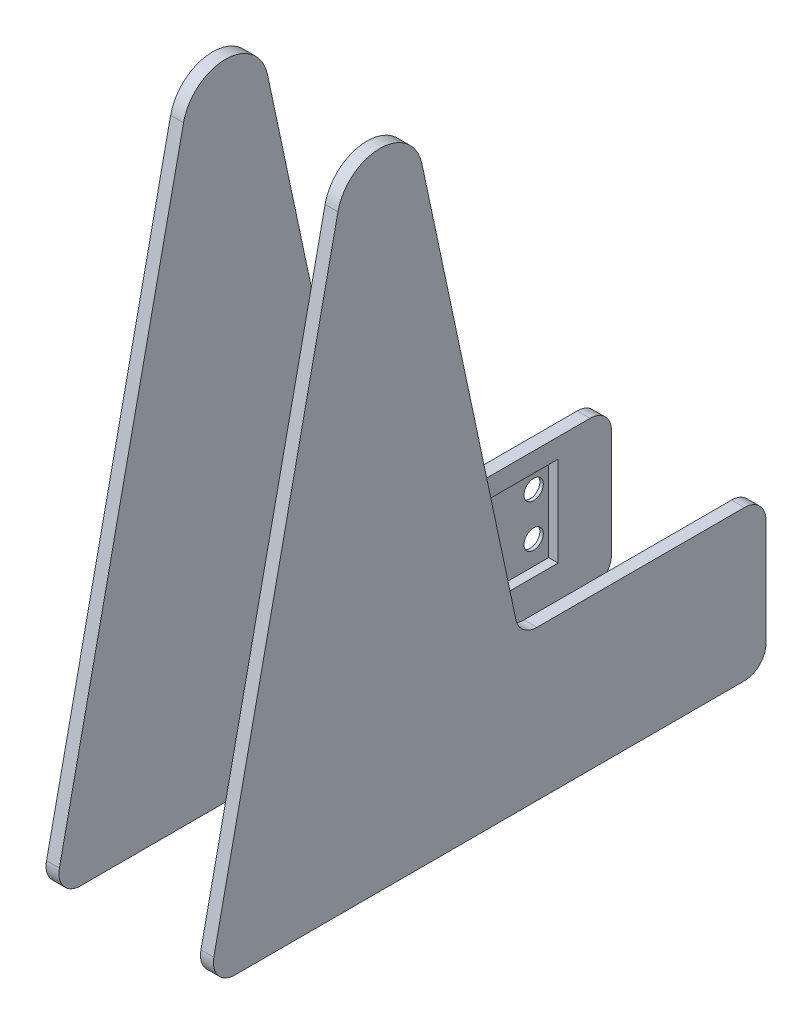
ISO-10303-21;
HEADER;
FILE_DESCRIPTION(('STEP AP214'),'2;1');
FILE_NAME('part.step','',(''),(''),'','','');
FILE_SCHEMA(('AUTOMOTIVE_DESIGN { 1 0 10303 214 1 1 1 1 }'));
ENDSEC;
DATA;
#1=APPLICATION_CONTEXT('core data for automotive mechanical design processes');
#2=APPLICATION_PROTOCOL_DEFINITION('international standard','automotive_design',2000,#1);
#3=PRODUCT_CONTEXT('',#1,'mechanical');
#4=PRODUCT('Part','Part','',(#3));
#5=PRODUCT_RELATED_PRODUCT_CATEGORY('part','',(#4));
#6=PRODUCT_DEFINITION_FORMATION('','',#4);
#7=PRODUCT_DEFINITION_CONTEXT('part definition',#1,'design');
#8=PRODUCT_DEFINITION('design','',#6,#7);
#9=PRODUCT_DEFINITION_SHAPE('','',#8);
#10=(LENGTH_UNIT() NAMED_UNIT(*) SI_UNIT(.MILLI.,.METRE.));
#11=(NAMED_UNIT(*) PLANE_ANGLE_UNIT() SI_UNIT($,.RADIAN.));
#12=(NAMED_UNIT(*) SI_UNIT($,.STERADIAN.) SOLID_ANGLE_UNIT());
#13=UNCERTAINTY_MEASURE_WITH_UNIT(LENGTH_MEASURE(1.E-05),#10,'distance_accuracy_value','');
#14=(GEOMETRIC_REPRESENTATION_CONTEXT(3) GLOBAL_UNCERTAINTY_ASSIGNED_CONTEXT((#13)) GLOBAL_UNIT_ASSIGNED_CONTEXT((#10,
#11,#12)) REPRESENTATION_CONTEXT('',''));
#15=CARTESIAN_POINT('',(0.,0.,0.));
#16=DIRECTION('',(0.,0.,1.));
#17=DIRECTION('',(1.,0.,0.));
#18=AXIS2_PLACEMENT_3D('',#15,#16,#17);
#19=CARTESIAN_POINT('',(-19.5,0.,0.));
#20=DIRECTION('',(-1.,0.,0.));
#21=DIRECTION('',(0.,0.,-1.));
#22=AXIS2_PLACEMENT_3D('',#19,#20,#21);
#23=PLANE('',#22);
#24=CARTESIAN_POINT('',(-19.5,15.,-25.55));
#25=DIRECTION('',(1.,0.,0.));
#26=DIRECTION('',(0.,0.,-1.));
#27=AXIS2_PLACEMENT_3D('',#24,#25,#26);
#28=CIRCLE('',#27,2.25);
#29=CARTESIAN_POINT('',(-19.5,15.,-27.8));
#30=VERTEX_POINT('',#29);
#31=EDGE_CURVE('E408',#30,#30,#28,.T.);
#32=ORIENTED_EDGE('',*,*,#31,.T.);
#33=EDGE_LOOP('',(#32));
#34=FACE_BOUND('',#33,.T.);
#35=CARTESIAN_POINT('',(-19.5,140.,0.));
#36=DIRECTION('',(1.,0.,0.));
#37=DIRECTION('',(0.,0.,-1.));
#38=AXIS2_PLACEMENT_3D('',#35,#36,#37);
#39=CIRCLE('',#38,9.99999999999999);
#40=CARTESIAN_POINT('',(-19.5,142.080346989874,9.78121446456016));
#41=VERTEX_POINT('',#40);
#42=CARTESIAN_POINT('',(-19.5,142.080346989874,-9.78121446456015));
#43=VERTEX_POINT('',#42);
#44=EDGE_CURVE('E199',#41,#43,#39,.F.);
#45=ORIENTED_EDGE('',*,*,#44,.T.);
#46=DIRECTION('',(0.,-0.978121446456016,-0.208034698987433));
#47=VECTOR('',#46,1.);
#48=CARTESIAN_POINT('',(-19.5,8.1393280274652,-38.2688625606883));
#49=LINE('',#48,#47);
#50=CARTESIAN_POINT('',(-19.5,38.9598265050628,-31.7137122297545));
#51=VERTEX_POINT('',#50);
#52=EDGE_CURVE('E77',#43,#51,#49,.T.);
#53=ORIENTED_EDGE('',*,*,#52,.T.);
#54=CARTESIAN_POINT('',(-19.5,40.,-36.6043194620345));
#55=DIRECTION('',(1.,0.,0.));
#56=DIRECTION('',(0.,0.,-1.));
#57=AXIS2_PLACEMENT_3D('',#54,#55,#56);
#58=CIRCLE('',#57,5.);
#59=CARTESIAN_POINT('',(-19.5,35.,-36.6043194620345));
#60=VERTEX_POINT('',#59);
#61=EDGE_CURVE('E145',#60,#51,#58,.F.);
#62=ORIENTED_EDGE('',*,*,#61,.F.);
#63=DIRECTION('',(0.,0.,-1.));
#64=VECTOR('',#63,1.);
#65=CARTESIAN_POINT('',(-19.5,35.,0.));
#66=LINE('',#65,#64);
#67=CARTESIAN_POINT('',(-19.5,35.,-85.));
#68=VERTEX_POINT('',#67);
#69=EDGE_CURVE('E149',#60,#68,#66,.T.);
#70=ORIENTED_EDGE('',*,*,#69,.T.);
#71=CARTESIAN_POINT('',(-19.5,30.,-85.));
#72=DIRECTION('',(1.,0.,0.));
#73=DIRECTION('',(0.,0.,-1.));
#74=AXIS2_PLACEMENT_3D('',#71,#72,#73);
#75=CIRCLE('',#74,5.);
#76=CARTESIAN_POINT('',(-19.5,30.,-90.));
#77=VERTEX_POINT('',#76);
#78=EDGE_CURVE('E166',#77,#68,#75,.T.);
#79=ORIENTED_EDGE('',*,*,#78,.F.);
#80=DIRECTION('',(0.,-1.,0.));
#81=VECTOR('',#80,1.);
#82=CARTESIAN_POINT('',(-19.5,0.,-90.));
#83=LINE('',#82,#81);
#84=CARTESIAN_POINT('',(-19.5,5.,-90.));
#85=VERTEX_POINT('',#84);
#86=EDGE_CURVE('E168',#77,#85,#83,.T.);
#87=ORIENTED_EDGE('',*,*,#86,.T.);
#88=CARTESIAN_POINT('',(-19.5,5.,-85.));
#89=DIRECTION('',(1.,0.,0.));
#90=DIRECTION('',(0.,0.,-1.));
#91=AXIS2_PLACEMENT_3D('',#88,#89,#90);
#92=CIRCLE('',#91,5.);
#93=CARTESIAN_POINT('',(-19.5,0.,-85.));
#94=VERTEX_POINT('',#93);
#95=EDGE_CURVE('E234',#94,#85,#92,.T.);
#96=ORIENTED_EDGE('',*,*,#95,.F.);
#97=DIRECTION('',(0.,0.,-1.));
#98=VECTOR('',#97,1.);
#99=CARTESIAN_POINT('',(-19.5,0.,0.));
#100=LINE('',#99,#98);
#101=CARTESIAN_POINT('',(-19.5,0.,33.8247203178887));
#102=VERTEX_POINT('',#101);
#103=EDGE_CURVE('E231',#102,#94,#100,.T.);
#104=ORIENTED_EDGE('',*,*,#103,.F.);
#105=CARTESIAN_POINT('',(-19.5,5.,33.8247203178887));
#106=DIRECTION('',(1.,0.,0.));
#107=DIRECTION('',(0.,0.,-1.));
#108=AXIS2_PLACEMENT_3D('',#105,#106,#107);
#109=CIRCLE('',#108,4.99999999999999);
#110=CARTESIAN_POINT('',(-19.5,6.04017349493716,38.7153275501688));
#111=VERTEX_POINT('',#110);
#112=EDGE_CURVE('E225',#111,#102,#109,.T.);
#113=ORIENTED_EDGE('',*,*,#112,.F.);
#114=DIRECTION('',(0.,-0.978121446456016,0.208034698987433));
#115=VECTOR('',#114,1.);
#116=CARTESIAN_POINT('',(-19.5,8.13932802746519,38.2688625606883));
#117=LINE('',#116,#115);
#118=EDGE_CURVE('E123',#41,#111,#117,.T.);
#119=ORIENTED_EDGE('',*,*,#118,.F.);
#120=EDGE_LOOP('',(#45,#53,#62,#70,#79,#87,#96,#104,#113,#119));
#121=FACE_BOUND('',#120,.T.);
#122=CARTESIAN_POINT('',(-19.5,25.,-25.55));
#123=DIRECTION('',(1.,0.,0.));
#124=DIRECTION('',(0.,0.,-1.));
#125=AXIS2_PLACEMENT_3D('',#122,#123,#124);
#126=CIRCLE('',#125,2.25);
#127=CARTESIAN_POINT('',(-19.5,25.,-27.8));
#128=VERTEX_POINT('',#127);
#129=EDGE_CURVE('E430',#128,#128,#126,.T.);
#130=ORIENTED_EDGE('',*,*,#129,.T.);
#131=EDGE_LOOP('',(#130));
#132=FACE_BOUND('',#131,.T.);
#133=CARTESIAN_POINT('',(-19.5,25.,-74.05));
#134=DIRECTION('',(1.,0.,0.));
#135=DIRECTION('',(0.,0.,-1.));
#136=AXIS2_PLACEMENT_3D('',#133,#134,#135);
#137=CIRCLE('',#136,2.25);
#138=CARTESIAN_POINT('',(-19.5,25.,-76.3));
#139=VERTEX_POINT('',#138);
#140=EDGE_CURVE('E424',#139,#139,#137,.T.);
#141=ORIENTED_EDGE('',*,*,#140,.T.);
#142=EDGE_LOOP('',(#141));
#143=FACE_BOUND('',#142,.T.);
#144=CARTESIAN_POINT('',(-19.5,15.,-74.05));
#145=DIRECTION('',(1.,0.,0.));
#146=DIRECTION('',(0.,0.,-1.));
#147=AXIS2_PLACEMENT_3D('',#144,#145,#146);
#148=CIRCLE('',#147,2.25);
#149=CARTESIAN_POINT('',(-19.5,15.,-76.3));
#150=VERTEX_POINT('',#149);
#151=EDGE_CURVE('E418',#150,#150,#148,.T.);
#152=ORIENTED_EDGE('',*,*,#151,.T.);
#153=EDGE_LOOP('',(#152));
#154=FACE_BOUND('',#153,.T.);
#155=ADVANCED_FACE('F53',(#34,#121,#132,#143,#154),#23,.T.);
#156=CARTESIAN_POINT('',(-18.7,0.,0.));
#157=DIRECTION('',(-1.,0.,0.));
#158=DIRECTION('',(0.,0.,1.));
#159=AXIS2_PLACEMENT_3D('',#156,#157,#158);
#160=PLANE('',#159);
#161=CARTESIAN_POINT('',(-18.7,15.,-25.55));
#162=DIRECTION('',(1.,0.,0.));
#163=DIRECTION('',(0.,0.,-1.));
#164=AXIS2_PLACEMENT_3D('',#161,#162,#163);
#165=CIRCLE('',#164,2.25);
#166=CARTESIAN_POINT('',(-18.7,15.,-27.8));
#167=VERTEX_POINT('',#166);
#168=EDGE_CURVE('E411',#167,#167,#165,.T.);
#169=ORIENTED_EDGE('',*,*,#168,.F.);
#170=EDGE_LOOP('',(#169));
#171=FACE_BOUND('',#170,.T.);
#172=CARTESIAN_POINT('',(-18.7,15.,-74.05));
#173=DIRECTION('',(1.,0.,0.));
#174=DIRECTION('',(0.,0.,-1.));
#175=AXIS2_PLACEMENT_3D('',#172,#173,#174);
#176=CIRCLE('',#175,2.25);
#177=CARTESIAN_POINT('',(-18.7,15.,-76.3));
#178=VERTEX_POINT('',#177);
#179=EDGE_CURVE('E413',#178,#178,#176,.T.);
#180=ORIENTED_EDGE('',*,*,#179,.F.);
#181=EDGE_LOOP('',(#180));
#182=FACE_BOUND('',#181,.T.);
#183=CARTESIAN_POINT('',(-18.7,25.,-25.55));
#184=DIRECTION('',(1.,0.,0.));
#185=DIRECTION('',(0.,0.,-1.));
#186=AXIS2_PLACEMENT_3D('',#183,#184,#185);
#187=CIRCLE('',#186,2.25);
#188=CARTESIAN_POINT('',(-18.7,25.,-27.8));
#189=VERTEX_POINT('',#188);
#190=EDGE_CURVE('E427',#189,#189,#187,.T.);
#191=ORIENTED_EDGE('',*,*,#190,.F.);
#192=EDGE_LOOP('',(#191));
#193=FACE_BOUND('',#192,.T.);
#194=DIRECTION('',(0.,1.,0.));
#195=VECTOR('',#194,1.);
#196=CARTESIAN_POINT('',(-18.7,30.4866025403784,-22.05));
#197=LINE('',#196,#195);
#198=CARTESIAN_POINT('',(-18.7,9.5,-22.05));
#199=VERTEX_POINT('',#198);
#200=CARTESIAN_POINT('',(-18.7,30.4866025403784,-22.05));
#201=VERTEX_POINT('',#200);
#202=EDGE_CURVE('E440',#199,#201,#197,.T.);
#203=ORIENTED_EDGE('',*,*,#202,.F.);
#204=DIRECTION('',(0.,0.,1.));
#205=VECTOR('',#204,1.);
#206=CARTESIAN_POINT('',(-18.7,9.5,-77.55));
#207=LINE('',#206,#205);
#208=CARTESIAN_POINT('',(-18.7,9.5,-77.55));
#209=VERTEX_POINT('',#208);
#210=EDGE_CURVE('E449',#209,#199,#207,.T.);
#211=ORIENTED_EDGE('',*,*,#210,.F.);
#212=DIRECTION('',(0.,-1.,0.));
#213=VECTOR('',#212,1.);
#214=CARTESIAN_POINT('',(-18.7,30.4866025403784,-77.55));
#215=LINE('',#214,#213);
#216=CARTESIAN_POINT('',(-18.7,30.4866025403784,-77.55));
#217=VERTEX_POINT('',#216);
#218=EDGE_CURVE('E446',#217,#209,#215,.T.);
#219=ORIENTED_EDGE('',*,*,#218,.F.);
#220=DIRECTION('',(0.,0.,-1.));
#221=VECTOR('',#220,1.);
#222=CARTESIAN_POINT('',(-18.7,30.4866025403784,-77.55));
#223=LINE('',#222,#221);
#224=EDGE_CURVE('E443',#201,#217,#223,.T.);
#225=ORIENTED_EDGE('',*,*,#224,.F.);
#226=EDGE_LOOP('',(#203,#211,#219,#225));
#227=FACE_BOUND('',#226,.T.);
#228=CARTESIAN_POINT('',(-18.7,25.,-74.05));
#229=DIRECTION('',(1.,0.,0.));
#230=DIRECTION('',(0.,0.,-1.));
#231=AXIS2_PLACEMENT_3D('',#228,#229,#230);
#232=CIRCLE('',#231,2.25);
#233=CARTESIAN_POINT('',(-18.7,25.,-76.3));
#234=VERTEX_POINT('',#233);
#235=EDGE_CURVE('E421',#234,#234,#232,.T.);
#236=ORIENTED_EDGE('',*,*,#235,.F.);
#237=EDGE_LOOP('',(#236));
#238=FACE_BOUND('',#237,.T.);
#239=ADVANCED_FACE('F257',(#171,#182,#193,#227,#238),#160,.F.);
#240=CARTESIAN_POINT('',(-19.5,140.,0.));
#241=DIRECTION('',(1.,0.,0.));
#242=DIRECTION('',(0.,-1.,0.));
#243=AXIS2_PLACEMENT_3D('',#240,#241,#242);
#244=CYLINDRICAL_SURFACE('',#243,9.99999999999999);
#245=CARTESIAN_POINT('',(-16.5,140.,0.));
#246=DIRECTION('',(1.,0.,0.));
#247=DIRECTION('',(0.,0.,-1.));
#248=AXIS2_PLACEMENT_3D('',#245,#246,#247);
#249=CIRCLE('',#248,9.99999999999999);
#250=CARTESIAN_POINT('',(-16.5,142.080346989874,9.78121446456016));
#251=VERTEX_POINT('',#250);
#252=CARTESIAN_POINT('',(-16.5,142.080346989874,-9.78121446456015));
#253=VERTEX_POINT('',#252);
#254=EDGE_CURVE('E174',#251,#253,#249,.F.);
#255=ORIENTED_EDGE('',*,*,#254,.T.);
#256=DIRECTION('',(1.,0.,0.));
#257=VECTOR('',#256,1.);
#258=CARTESIAN_POINT('',(-19.5,142.080346989874,-9.78121446456015));
#259=LINE('',#258,#257);
#260=EDGE_CURVE('E173',#43,#253,#259,.T.);
#261=ORIENTED_EDGE('',*,*,#260,.F.);
#262=ORIENTED_EDGE('',*,*,#44,.F.);
#263=DIRECTION('',(1.,0.,0.));
#264=VECTOR('',#263,1.);
#265=CARTESIAN_POINT('',(-19.5,142.080346989874,9.78121446456016));
#266=LINE('',#265,#264);
#267=EDGE_CURVE('E12',#41,#251,#266,.T.);
#268=ORIENTED_EDGE('',*,*,#267,.T.);
#269=EDGE_LOOP('',(#255,#261,#262,#268));
#270=FACE_BOUND('',#269,.T.);
#271=ADVANCED_FACE('F55',(#270),#244,.T.);
#272=CARTESIAN_POINT('',(-19.5,8.13932802746519,38.2688625606883));
#273=DIRECTION('',(0.,-0.208034698987433,-0.978121446456016));
#274=DIRECTION('',(0.,0.978121446456016,-0.208034698987433));
#275=AXIS2_PLACEMENT_3D('',#272,#273,#274);
#276=PLANE('',#275);
#277=DIRECTION('',(0.,-0.978121446456016,0.208034698987433));
#278=VECTOR('',#277,1.);
#279=CARTESIAN_POINT('',(-16.5,8.13932802746519,38.2688625606883));
#280=LINE('',#279,#278);
#281=CARTESIAN_POINT('',(-16.5,6.04017349493716,38.7153275501688));
#282=VERTEX_POINT('',#281);
#283=EDGE_CURVE('E177',#251,#282,#280,.T.);
#284=ORIENTED_EDGE('',*,*,#283,.F.);
#285=ORIENTED_EDGE('',*,*,#267,.F.);
#286=ORIENTED_EDGE('',*,*,#118,.T.);
#287=DIRECTION('',(1.,0.,0.));
#288=VECTOR('',#287,1.);
#289=CARTESIAN_POINT('',(-19.5,6.04017349493716,38.7153275501688));
#290=LINE('',#289,#288);
#291=EDGE_CURVE('E61',#111,#282,#290,.T.);
#292=ORIENTED_EDGE('',*,*,#291,.T.);
#293=EDGE_LOOP('',(#284,#285,#286,#292));
#294=FACE_BOUND('',#293,.T.);
#295=ADVANCED_FACE('F217',(#294),#276,.F.);
#296=CARTESIAN_POINT('',(-19.5,5.,33.8247203178887));
#297=DIRECTION('',(1.,0.,0.));
#298=DIRECTION('',(0.,-1.,0.));
#299=AXIS2_PLACEMENT_3D('',#296,#297,#298);
#300=CYLINDRICAL_SURFACE('',#299,4.99999999999999);
#301=CARTESIAN_POINT('',(-16.5,5.,33.8247203178887));
#302=DIRECTION('',(1.,0.,0.));
#303=DIRECTION('',(0.,0.,-1.));
#304=AXIS2_PLACEMENT_3D('',#301,#302,#303);
#305=CIRCLE('',#304,4.99999999999999);
#306=CARTESIAN_POINT('',(-16.5,0.,33.8247203178887));
#307=VERTEX_POINT('',#306);
#308=EDGE_CURVE('E181',#282,#307,#305,.T.);
#309=ORIENTED_EDGE('',*,*,#308,.F.);
#310=ORIENTED_EDGE('',*,*,#291,.F.);
#311=ORIENTED_EDGE('',*,*,#112,.T.);
#312=DIRECTION('',(1.,0.,0.));
#313=VECTOR('',#312,1.);
#314=CARTESIAN_POINT('',(-19.5,0.,33.8247203178887));
#315=LINE('',#314,#313);
#316=EDGE_CURVE('E212',#102,#307,#315,.T.);
#317=ORIENTED_EDGE('',*,*,#316,.T.);
#318=EDGE_LOOP('',(#309,#310,#311,#317));
#319=FACE_BOUND('',#318,.T.);
#320=ADVANCED_FACE('F248',(#319),#300,.T.);
#321=CARTESIAN_POINT('',(-19.5,0.,0.));
#322=DIRECTION('',(0.,1.,0.));
#323=DIRECTION('',(1.,0.,0.));
#324=AXIS2_PLACEMENT_3D('',#321,#322,#323);
#325=PLANE('',#324);
#326=DIRECTION('',(0.,0.,-1.));
#327=VECTOR('',#326,1.);
#328=CARTESIAN_POINT('',(-16.5,0.,0.));
#329=LINE('',#328,#327);
#330=CARTESIAN_POINT('',(-16.5,0.,-85.));
#331=VERTEX_POINT('',#330);
#332=EDGE_CURVE('E184',#307,#331,#329,.T.);
#333=ORIENTED_EDGE('',*,*,#332,.F.);
#334=ORIENTED_EDGE('',*,*,#316,.F.);
#335=ORIENTED_EDGE('',*,*,#103,.T.);
#336=DIRECTION('',(1.,0.,0.));
#337=VECTOR('',#336,1.);
#338=CARTESIAN_POINT('',(-19.5,0.,-85.));
#339=LINE('',#338,#337);
#340=EDGE_CURVE('E209',#94,#331,#339,.T.);
#341=ORIENTED_EDGE('',*,*,#340,.T.);
#342=EDGE_LOOP('',(#333,#334,#335,#341));
#343=FACE_BOUND('',#342,.T.);
#344=ADVANCED_FACE('F247',(#343),#325,.F.);
#345=CARTESIAN_POINT('',(-19.5,5.,-85.));
#346=DIRECTION('',(1.,0.,0.));
#347=DIRECTION('',(0.,-1.,0.));
#348=AXIS2_PLACEMENT_3D('',#345,#346,#347);
#349=CYLINDRICAL_SURFACE('',#348,5.);
#350=CARTESIAN_POINT('',(-16.5,5.,-85.));
#351=DIRECTION('',(1.,0.,0.));
#352=DIRECTION('',(0.,0.,-1.));
#353=AXIS2_PLACEMENT_3D('',#350,#351,#352);
#354=CIRCLE('',#353,5.);
#355=CARTESIAN_POINT('',(-16.5,5.,-90.));
#356=VERTEX_POINT('',#355);
#357=EDGE_CURVE('E187',#331,#356,#354,.T.);
#358=ORIENTED_EDGE('',*,*,#357,.F.);
#359=ORIENTED_EDGE('',*,*,#340,.F.);
#360=ORIENTED_EDGE('',*,*,#95,.T.);
#361=DIRECTION('',(1.,0.,0.));
#362=VECTOR('',#361,1.);
#363=CARTESIAN_POINT('',(-19.5,5.,-90.));
#364=LINE('',#363,#362);
#365=EDGE_CURVE('E206',#85,#356,#364,.T.);
#366=ORIENTED_EDGE('',*,*,#365,.T.);
#367=EDGE_LOOP('',(#358,#359,#360,#366));
#368=FACE_BOUND('',#367,.T.);
#369=ADVANCED_FACE('F244',(#368),#349,.T.);
#370=CARTESIAN_POINT('',(-19.5,0.,-90.));
#371=DIRECTION('',(0.,0.,-1.));
#372=DIRECTION('',(1.,0.,0.));
#373=AXIS2_PLACEMENT_3D('',#370,#371,#372);
#374=PLANE('',#373);
#375=DIRECTION('',(0.,-1.,0.));
#376=VECTOR('',#375,1.);
#377=CARTESIAN_POINT('',(-16.5,0.,-90.));
#378=LINE('',#377,#376);
#379=CARTESIAN_POINT('',(-16.5,30.,-90.));
#380=VERTEX_POINT('',#379);
#381=EDGE_CURVE('E190',#380,#356,#378,.T.);
#382=ORIENTED_EDGE('',*,*,#381,.T.);
#383=ORIENTED_EDGE('',*,*,#365,.F.);
#384=ORIENTED_EDGE('',*,*,#86,.F.);
#385=DIRECTION('',(1.,0.,0.));
#386=VECTOR('',#385,1.);
#387=CARTESIAN_POINT('',(-19.5,30.,-90.));
#388=LINE('',#387,#386);
#389=EDGE_CURVE('E203',#77,#380,#388,.T.);
#390=ORIENTED_EDGE('',*,*,#389,.T.);
#391=EDGE_LOOP('',(#382,#383,#384,#390));
#392=FACE_BOUND('',#391,.T.);
#393=ADVANCED_FACE('F241',(#392),#374,.T.);
#394=CARTESIAN_POINT('',(-19.5,30.,-85.));
#395=DIRECTION('',(1.,0.,0.));
#396=DIRECTION('',(0.,-1.,0.));
#397=AXIS2_PLACEMENT_3D('',#394,#395,#396);
#398=CYLINDRICAL_SURFACE('',#397,5.);
#399=CARTESIAN_POINT('',(-16.5,30.,-85.));
#400=DIRECTION('',(1.,0.,0.));
#401=DIRECTION('',(0.,0.,-1.));
#402=AXIS2_PLACEMENT_3D('',#399,#400,#401);
#403=CIRCLE('',#402,5.);
#404=CARTESIAN_POINT('',(-16.5,35.,-85.));
#405=VERTEX_POINT('',#404);
#406=EDGE_CURVE('E192',#380,#405,#403,.T.);
#407=ORIENTED_EDGE('',*,*,#406,.F.);
#408=ORIENTED_EDGE('',*,*,#389,.F.);
#409=ORIENTED_EDGE('',*,*,#78,.T.);
#410=DIRECTION('',(1.,0.,0.));
#411=VECTOR('',#410,1.);
#412=CARTESIAN_POINT('',(-19.5,35.,-85.));
#413=LINE('',#412,#411);
#414=EDGE_CURVE('E160',#68,#405,#413,.T.);
#415=ORIENTED_EDGE('',*,*,#414,.T.);
#416=EDGE_LOOP('',(#407,#408,#409,#415));
#417=FACE_BOUND('',#416,.T.);
#418=ADVANCED_FACE('F281',(#417),#398,.T.);
#419=CARTESIAN_POINT('',(-19.5,35.,0.));
#420=DIRECTION('',(0.,1.,0.));
#421=DIRECTION('',(0.,0.,1.));
#422=AXIS2_PLACEMENT_3D('',#419,#420,#421);
#423=PLANE('',#422);
#424=DIRECTION('',(0.,0.,-1.));
#425=VECTOR('',#424,1.);
#426=CARTESIAN_POINT('',(-16.5,35.,0.));
#427=LINE('',#426,#425);
#428=CARTESIAN_POINT('',(-16.5,35.,-36.6043194620345));
#429=VERTEX_POINT('',#428);
#430=EDGE_CURVE('E195',#429,#405,#427,.T.);
#431=ORIENTED_EDGE('',*,*,#430,.T.);
#432=ORIENTED_EDGE('',*,*,#414,.F.);
#433=ORIENTED_EDGE('',*,*,#69,.F.);
#434=DIRECTION('',(1.,0.,0.));
#435=VECTOR('',#434,1.);
#436=CARTESIAN_POINT('',(-19.5,35.,-36.6043194620345));
#437=LINE('',#436,#435);
#438=EDGE_CURVE('E155',#60,#429,#437,.T.);
#439=ORIENTED_EDGE('',*,*,#438,.T.);
#440=EDGE_LOOP('',(#431,#432,#433,#439));
#441=FACE_BOUND('',#440,.T.);
#442=ADVANCED_FACE('F163',(#441),#423,.T.);
#443=CARTESIAN_POINT('',(-19.5,40.,-36.6043194620345));
#444=DIRECTION('',(1.,0.,0.));
#445=DIRECTION('',(0.,-1.,0.));
#446=AXIS2_PLACEMENT_3D('',#443,#444,#445);
#447=CYLINDRICAL_SURFACE('',#446,5.);
#448=CARTESIAN_POINT('',(-16.5,40.,-36.6043194620345));
#449=DIRECTION('',(1.,0.,0.));
#450=DIRECTION('',(0.,0.,-1.));
#451=AXIS2_PLACEMENT_3D('',#448,#449,#450);
#452=CIRCLE('',#451,5.);
#453=CARTESIAN_POINT('',(-16.5,38.9598265050628,-31.7137122297545));
#454=VERTEX_POINT('',#453);
#455=EDGE_CURVE('E157',#429,#454,#452,.F.);
#456=ORIENTED_EDGE('',*,*,#455,.F.);
#457=ORIENTED_EDGE('',*,*,#438,.F.);
#458=ORIENTED_EDGE('',*,*,#61,.T.);
#459=DIRECTION('',(1.,0.,0.));
#460=VECTOR('',#459,1.);
#461=CARTESIAN_POINT('',(-19.5,38.9598265050628,-31.7137122297545));
#462=LINE('',#461,#460);
#463=EDGE_CURVE('E161',#51,#454,#462,.T.);
#464=ORIENTED_EDGE('',*,*,#463,.T.);
#465=EDGE_LOOP('',(#456,#457,#458,#464));
#466=FACE_BOUND('',#465,.T.);
#467=ADVANCED_FACE('F156',(#466),#447,.F.);
#468=CARTESIAN_POINT('',(-19.5,8.1393280274652,-38.2688625606883));
#469=DIRECTION('',(0.,0.208034698987433,-0.978121446456016));
#470=DIRECTION('',(0.,0.978121446456016,0.208034698987433));
#471=AXIS2_PLACEMENT_3D('',#468,#469,#470);
#472=PLANE('',#471);
#473=DIRECTION('',(0.,-0.978121446456016,-0.208034698987433));
#474=VECTOR('',#473,1.);
#475=CARTESIAN_POINT('',(-16.5,8.1393280274652,-38.2688625606883));
#476=LINE('',#475,#474);
#477=EDGE_CURVE('E116',#253,#454,#476,.T.);
#478=ORIENTED_EDGE('',*,*,#477,.T.);
#479=ORIENTED_EDGE('',*,*,#463,.F.);
#480=ORIENTED_EDGE('',*,*,#52,.F.);
#481=ORIENTED_EDGE('',*,*,#260,.T.);
#482=EDGE_LOOP('',(#478,#479,#480,#481));
#483=FACE_BOUND('',#482,.T.);
#484=ADVANCED_FACE('F273',(#483),#472,.T.);
#485=CARTESIAN_POINT('',(-16.5,0.,0.));
#486=DIRECTION('',(-1.,0.,0.));
#487=DIRECTION('',(0.,0.,-1.));
#488=AXIS2_PLACEMENT_3D('',#485,#486,#487);
#489=PLANE('',#488);
#490=DIRECTION('',(0.,0.,-1.));
#491=VECTOR('',#490,1.);
#492=CARTESIAN_POINT('',(-16.5,9.5,-77.55));
#493=LINE('',#492,#491);
#494=CARTESIAN_POINT('',(-16.5,9.5,-22.05));
#495=VERTEX_POINT('',#494);
#496=CARTESIAN_POINT('',(-16.5,9.5,-77.55));
#497=VERTEX_POINT('',#496);
#498=EDGE_CURVE('E434',#495,#497,#493,.T.);
#499=ORIENTED_EDGE('',*,*,#498,.F.);
#500=DIRECTION('',(0.,-1.,0.));
#501=VECTOR('',#500,1.);
#502=CARTESIAN_POINT('',(-16.5,30.4866025403784,-22.05));
#503=LINE('',#502,#501);
#504=CARTESIAN_POINT('',(-16.5,30.4866025403784,-22.05));
#505=VERTEX_POINT('',#504);
#506=EDGE_CURVE('E437',#505,#495,#503,.T.);
#507=ORIENTED_EDGE('',*,*,#506,.F.);
#508=DIRECTION('',(0.,0.,1.));
#509=VECTOR('',#508,1.);
#510=CARTESIAN_POINT('',(-16.5,30.4866025403784,-77.55));
#511=LINE('',#510,#509);
#512=CARTESIAN_POINT('',(-16.5,30.4866025403784,-77.55));
#513=VERTEX_POINT('',#512);
#514=EDGE_CURVE('E178',#513,#505,#511,.T.);
#515=ORIENTED_EDGE('',*,*,#514,.F.);
#516=DIRECTION('',(0.,1.,0.));
#517=VECTOR('',#516,1.);
#518=CARTESIAN_POINT('',(-16.5,30.4866025403784,-77.55));
#519=LINE('',#518,#517);
#520=EDGE_CURVE('E68',#497,#513,#519,.T.);
#521=ORIENTED_EDGE('',*,*,#520,.F.);
#522=EDGE_LOOP('',(#499,#507,#515,#521));
#523=FACE_BOUND('',#522,.T.);
#524=ORIENTED_EDGE('',*,*,#254,.F.);
#525=ORIENTED_EDGE('',*,*,#283,.T.);
#526=ORIENTED_EDGE('',*,*,#308,.T.);
#527=ORIENTED_EDGE('',*,*,#332,.T.);
#528=ORIENTED_EDGE('',*,*,#357,.T.);
#529=ORIENTED_EDGE('',*,*,#381,.F.);
#530=ORIENTED_EDGE('',*,*,#406,.T.);
#531=ORIENTED_EDGE('',*,*,#430,.F.);
#532=ORIENTED_EDGE('',*,*,#455,.T.);
#533=ORIENTED_EDGE('',*,*,#477,.F.);
#534=EDGE_LOOP('',(#524,#525,#526,#527,#528,#529,#530,#531,#532,#533));
#535=FACE_BOUND('',#534,.T.);
#536=ADVANCED_FACE('F220',(#523,#535),#489,.F.);
#537=CARTESIAN_POINT('',(19.501,30.4866025403784,-22.05));
#538=DIRECTION('',(0.,0.,1.));
#539=DIRECTION('',(1.,0.,0.));
#540=AXIS2_PLACEMENT_3D('',#537,#538,#539);
#541=PLANE('',#540);
#542=ORIENTED_EDGE('',*,*,#506,.T.);
#543=DIRECTION('',(-1.,0.,0.));
#544=VECTOR('',#543,1.);
#545=CARTESIAN_POINT('',(19.501,9.5,-22.05));
#546=LINE('',#545,#544);
#547=EDGE_CURVE('E453',#495,#199,#546,.T.);
#548=ORIENTED_EDGE('',*,*,#547,.T.);
#549=ORIENTED_EDGE('',*,*,#202,.T.);
#550=DIRECTION('',(-1.,0.,0.));
#551=VECTOR('',#550,1.);
#552=CARTESIAN_POINT('',(19.501,30.4866025403784,-22.05));
#553=LINE('',#552,#551);
#554=EDGE_CURVE('E452',#505,#201,#553,.T.);
#555=ORIENTED_EDGE('',*,*,#554,.F.);
#556=EDGE_LOOP('',(#542,#548,#549,#555));
#557=FACE_BOUND('',#556,.T.);
#558=ADVANCED_FACE('F269',(#557),#541,.F.);
#559=CARTESIAN_POINT('',(19.501,9.5,-77.55));
#560=DIRECTION('',(0.,-1.,0.));
#561=DIRECTION('',(1.,0.,0.));
#562=AXIS2_PLACEMENT_3D('',#559,#560,#561);
#563=PLANE('',#562);
#564=ORIENTED_EDGE('',*,*,#498,.T.);
#565=DIRECTION('',(-1.,0.,0.));
#566=VECTOR('',#565,1.);
#567=CARTESIAN_POINT('',(19.501,9.5,-77.55));
#568=LINE('',#567,#566);
#569=EDGE_CURVE('E456',#497,#209,#568,.T.);
#570=ORIENTED_EDGE('',*,*,#569,.T.);
#571=ORIENTED_EDGE('',*,*,#210,.T.);
#572=ORIENTED_EDGE('',*,*,#547,.F.);
#573=EDGE_LOOP('',(#564,#570,#571,#572));
#574=FACE_BOUND('',#573,.T.);
#575=ADVANCED_FACE('F329',(#574),#563,.F.);
#576=CARTESIAN_POINT('',(19.501,30.4866025403784,-77.55));
#577=DIRECTION('',(0.,0.,-1.));
#578=DIRECTION('',(-1.,0.,0.));
#579=AXIS2_PLACEMENT_3D('',#576,#577,#578);
#580=PLANE('',#579);
#581=ORIENTED_EDGE('',*,*,#520,.T.);
#582=DIRECTION('',(-1.,0.,0.));
#583=VECTOR('',#582,1.);
#584=CARTESIAN_POINT('',(19.501,30.4866025403784,-77.55));
#585=LINE('',#584,#583);
#586=EDGE_CURVE('E459',#513,#217,#585,.T.);
#587=ORIENTED_EDGE('',*,*,#586,.T.);
#588=ORIENTED_EDGE('',*,*,#218,.T.);
#589=ORIENTED_EDGE('',*,*,#569,.F.);
#590=EDGE_LOOP('',(#581,#587,#588,#589));
#591=FACE_BOUND('',#590,.T.);
#592=ADVANCED_FACE('F337',(#591),#580,.F.);
#593=CARTESIAN_POINT('',(19.501,30.4866025403784,-77.55));
#594=DIRECTION('',(0.,1.,0.));
#595=DIRECTION('',(-1.,0.,0.));
#596=AXIS2_PLACEMENT_3D('',#593,#594,#595);
#597=PLANE('',#596);
#598=ORIENTED_EDGE('',*,*,#514,.T.);
#599=ORIENTED_EDGE('',*,*,#554,.T.);
#600=ORIENTED_EDGE('',*,*,#224,.T.);
#601=ORIENTED_EDGE('',*,*,#586,.F.);
#602=EDGE_LOOP('',(#598,#599,#600,#601));
#603=FACE_BOUND('',#602,.T.);
#604=ADVANCED_FACE('F345',(#603),#597,.F.);
#605=CARTESIAN_POINT('',(-18.7,25.,-25.55));
#606=DIRECTION('',(1.,0.,0.));
#607=DIRECTION('',(0.,0.,-1.));
#608=AXIS2_PLACEMENT_3D('',#605,#606,#607);
#609=CYLINDRICAL_SURFACE('',#608,2.25);
#610=ORIENTED_EDGE('',*,*,#129,.F.);
#611=EDGE_LOOP('',(#610));
#612=FACE_BOUND('',#611,.T.);
#613=ORIENTED_EDGE('',*,*,#190,.T.);
#614=EDGE_LOOP('',(#613));
#615=FACE_BOUND('',#614,.T.);
#616=ADVANCED_FACE('F352',(#612,#615),#609,.F.);
#617=CARTESIAN_POINT('',(-18.7,25.,-74.05));
#618=DIRECTION('',(1.,0.,0.));
#619=DIRECTION('',(0.,0.,-1.));
#620=AXIS2_PLACEMENT_3D('',#617,#618,#619);
#621=CYLINDRICAL_SURFACE('',#620,2.25);
#622=ORIENTED_EDGE('',*,*,#140,.F.);
#623=EDGE_LOOP('',(#622));
#624=FACE_BOUND('',#623,.T.);
#625=ORIENTED_EDGE('',*,*,#235,.T.);
#626=EDGE_LOOP('',(#625));
#627=FACE_BOUND('',#626,.T.);
#628=ADVANCED_FACE('F373',(#624,#627),#621,.F.);
#629=CARTESIAN_POINT('',(-18.7,15.,-74.05));
#630=DIRECTION('',(1.,0.,0.));
#631=DIRECTION('',(0.,0.,-1.));
#632=AXIS2_PLACEMENT_3D('',#629,#630,#631);
#633=CYLINDRICAL_SURFACE('',#632,2.25);
#634=ORIENTED_EDGE('',*,*,#151,.F.);
#635=EDGE_LOOP('',(#634));
#636=FACE_BOUND('',#635,.T.);
#637=ORIENTED_EDGE('',*,*,#179,.T.);
#638=EDGE_LOOP('',(#637));
#639=FACE_BOUND('',#638,.T.);
#640=ADVANCED_FACE('F383',(#636,#639),#633,.F.);
#641=CARTESIAN_POINT('',(-18.7,15.,-25.55));
#642=DIRECTION('',(1.,0.,0.));
#643=DIRECTION('',(0.,0.,-1.));
#644=AXIS2_PLACEMENT_3D('',#641,#642,#643);
#645=CYLINDRICAL_SURFACE('',#644,2.25);
#646=ORIENTED_EDGE('',*,*,#31,.F.);
#647=EDGE_LOOP('',(#646));
#648=FACE_BOUND('',#647,.T.);
#649=ORIENTED_EDGE('',*,*,#168,.T.);
#650=EDGE_LOOP('',(#649));
#651=FACE_BOUND('',#650,.T.);
#652=ADVANCED_FACE('F393',(#648,#651),#645,.F.);
#653=CLOSED_SHELL('',(#155,#239,#271,#295,#320,#344,#369,#393,#418,#442,#467,#484,#536,#558,
#575,#592,#604,#616,#628,#640,#652));
#654=MANIFOLD_SOLID_BREP('B2',#653);
#655=CARTESIAN_POINT('',(19.5,140.,0.));
#656=DIRECTION('',(-1.,0.,0.));
#657=DIRECTION('',(0.,-1.,0.));
#658=AXIS2_PLACEMENT_3D('',#655,#656,#657);
#659=CYLINDRICAL_SURFACE('',#658,9.99999999999999);
#660=CARTESIAN_POINT('',(16.5,140.,0.));
#661=DIRECTION('',(1.,0.,0.));
#662=DIRECTION('',(0.,0.,-1.));
#663=AXIS2_PLACEMENT_3D('',#660,#661,#662);
#664=CIRCLE('',#663,9.99999999999999);
#665=CARTESIAN_POINT('',(16.5,142.080346989874,9.78121446456016));
#666=VERTEX_POINT('',#665);
#667=CARTESIAN_POINT('',(16.5,142.080346989874,-9.78121446456015));
#668=VERTEX_POINT('',#667);
#669=EDGE_CURVE('E643',#666,#668,#664,.F.);
#670=ORIENTED_EDGE('',*,*,#669,.F.);
#671=DIRECTION('',(-1.,0.,0.));
#672=VECTOR('',#671,1.);
#673=CARTESIAN_POINT('',(19.5,142.080346989874,9.78121446456016));
#674=LINE('',#673,#672);
#675=CARTESIAN_POINT('',(19.5,142.080346989874,9.78121446456016));
#676=VERTEX_POINT('',#675);
#677=EDGE_CURVE('E51',#676,#666,#674,.T.);
#678=ORIENTED_EDGE('',*,*,#677,.F.);
#679=CARTESIAN_POINT('',(19.5,140.,0.));
#680=DIRECTION('',(1.,0.,0.));
#681=DIRECTION('',(0.,0.,-1.));
#682=AXIS2_PLACEMENT_3D('',#679,#680,#681);
#683=CIRCLE('',#682,9.99999999999999);
#684=CARTESIAN_POINT('',(19.5,142.080346989874,-9.78121446456015));
#685=VERTEX_POINT('',#684);
#686=EDGE_CURVE('E666',#676,#685,#683,.F.);
#687=ORIENTED_EDGE('',*,*,#686,.T.);
#688=DIRECTION('',(-1.,0.,0.));
#689=VECTOR('',#688,1.);
#690=CARTESIAN_POINT('',(19.5,142.080346989874,-9.78121446456015));
#691=LINE('',#690,#689);
#692=EDGE_CURVE('E551',#685,#668,#691,.T.);
#693=ORIENTED_EDGE('',*,*,#692,.T.);
#694=EDGE_LOOP('',(#670,#678,#687,#693));
#695=FACE_BOUND('',#694,.T.);
#696=ADVANCED_FACE('F535',(#695),#659,.T.);
#697=CARTESIAN_POINT('',(19.5,8.13932802746519,38.2688625606883));
#698=DIRECTION('',(0.,-0.208034698987433,-0.978121446456016));
#699=DIRECTION('',(0.,0.978121446456016,-0.208034698987433));
#700=AXIS2_PLACEMENT_3D('',#697,#698,#699);
#701=PLANE('',#700);
#702=DIRECTION('',(0.,-0.978121446456016,0.208034698987433));
#703=VECTOR('',#702,1.);
#704=CARTESIAN_POINT('',(16.5,8.13932802746519,38.2688625606883));
#705=LINE('',#704,#703);
#706=CARTESIAN_POINT('',(16.5,6.04017349493716,38.7153275501688));
#707=VERTEX_POINT('',#706);
#708=EDGE_CURVE('E645',#666,#707,#705,.T.);
#709=ORIENTED_EDGE('',*,*,#708,.T.);
#710=DIRECTION('',(-1.,0.,0.));
#711=VECTOR('',#710,1.);
#712=CARTESIAN_POINT('',(19.5,6.04017349493716,38.7153275501688));
#713=LINE('',#712,#711);
#714=CARTESIAN_POINT('',(19.5,6.04017349493716,38.7153275501688));
#715=VERTEX_POINT('',#714);
#716=EDGE_CURVE('E543',#715,#707,#713,.T.);
#717=ORIENTED_EDGE('',*,*,#716,.F.);
#718=DIRECTION('',(0.,-0.978121446456016,0.208034698987433));
#719=VECTOR('',#718,1.);
#720=CARTESIAN_POINT('',(19.5,8.13932802746519,38.2688625606883));
#721=LINE('',#720,#719);
#722=EDGE_CURVE('E708',#676,#715,#721,.T.);
#723=ORIENTED_EDGE('',*,*,#722,.F.);
#724=ORIENTED_EDGE('',*,*,#677,.T.);
#725=EDGE_LOOP('',(#709,#717,#723,#724));
#726=FACE_BOUND('',#725,.T.);
#727=ADVANCED_FACE('F721',(#726),#701,.F.);
#728=CARTESIAN_POINT('',(19.5,5.,33.8247203178887));
#729=DIRECTION('',(-1.,0.,0.));
#730=DIRECTION('',(0.,-1.,0.));
#731=AXIS2_PLACEMENT_3D('',#728,#729,#730);
#732=CYLINDRICAL_SURFACE('',#731,4.99999999999999);
#733=CARTESIAN_POINT('',(16.5,5.,33.8247203178887));
#734=DIRECTION('',(1.,0.,0.));
#735=DIRECTION('',(0.,0.,-1.));
#736=AXIS2_PLACEMENT_3D('',#733,#734,#735);
#737=CIRCLE('',#736,4.99999999999999);
#738=CARTESIAN_POINT('',(16.5,0.,33.8247203178887));
#739=VERTEX_POINT('',#738);
#740=EDGE_CURVE('E647',#707,#739,#737,.T.);
#741=ORIENTED_EDGE('',*,*,#740,.T.);
#742=DIRECTION('',(-1.,0.,0.));
#743=VECTOR('',#742,1.);
#744=CARTESIAN_POINT('',(19.5,0.,33.8247203178887));
#745=LINE('',#744,#743);
#746=CARTESIAN_POINT('',(19.5,0.,33.8247203178887));
#747=VERTEX_POINT('',#746);
#748=EDGE_CURVE('E677',#747,#739,#745,.T.);
#749=ORIENTED_EDGE('',*,*,#748,.F.);
#750=CARTESIAN_POINT('',(19.5,5.,33.8247203178887));
#751=DIRECTION('',(1.,0.,0.));
#752=DIRECTION('',(0.,0.,-1.));
#753=AXIS2_PLACEMENT_3D('',#750,#751,#752);
#754=CIRCLE('',#753,4.99999999999999);
#755=EDGE_CURVE('E686',#715,#747,#754,.T.);
#756=ORIENTED_EDGE('',*,*,#755,.F.);
#757=ORIENTED_EDGE('',*,*,#716,.T.);
#758=EDGE_LOOP('',(#741,#749,#756,#757));
#759=FACE_BOUND('',#758,.T.);
#760=ADVANCED_FACE('F684',(#759),#732,.T.);
#761=CARTESIAN_POINT('',(19.5,0.,0.));
#762=DIRECTION('',(0.,1.,0.));
#763=DIRECTION('',(-1.,0.,0.));
#764=AXIS2_PLACEMENT_3D('',#761,#762,#763);
#765=PLANE('',#764);
#766=DIRECTION('',(0.,0.,-1.));
#767=VECTOR('',#766,1.);
#768=CARTESIAN_POINT('',(16.5,0.,0.));
#769=LINE('',#768,#767);
#770=CARTESIAN_POINT('',(16.5,0.,-85.));
#771=VERTEX_POINT('',#770);
#772=EDGE_CURVE('E649',#739,#771,#769,.T.);
#773=ORIENTED_EDGE('',*,*,#772,.T.);
#774=DIRECTION('',(-1.,0.,0.));
#775=VECTOR('',#774,1.);
#776=CARTESIAN_POINT('',(19.5,0.,-85.));
#777=LINE('',#776,#775);
#778=CARTESIAN_POINT('',(19.5,0.,-85.));
#779=VERTEX_POINT('',#778);
#780=EDGE_CURVE('E674',#779,#771,#777,.T.);
#781=ORIENTED_EDGE('',*,*,#780,.F.);
#782=DIRECTION('',(0.,0.,-1.));
#783=VECTOR('',#782,1.);
#784=CARTESIAN_POINT('',(19.5,0.,0.));
#785=LINE('',#784,#783);
#786=EDGE_CURVE('E703',#747,#779,#785,.T.);
#787=ORIENTED_EDGE('',*,*,#786,.F.);
#788=ORIENTED_EDGE('',*,*,#748,.T.);
#789=EDGE_LOOP('',(#773,#781,#787,#788));
#790=FACE_BOUND('',#789,.T.);
#791=ADVANCED_FACE('F695',(#790),#765,.F.);
#792=CARTESIAN_POINT('',(19.5,5.,-85.));
#793=DIRECTION('',(-1.,0.,0.));
#794=DIRECTION('',(0.,-1.,0.));
#795=AXIS2_PLACEMENT_3D('',#792,#793,#794);
#796=CYLINDRICAL_SURFACE('',#795,5.);
#797=CARTESIAN_POINT('',(16.5,5.,-85.));
#798=DIRECTION('',(1.,0.,0.));
#799=DIRECTION('',(0.,0.,-1.));
#800=AXIS2_PLACEMENT_3D('',#797,#798,#799);
#801=CIRCLE('',#800,5.);
#802=CARTESIAN_POINT('',(16.5,5.,-90.));
#803=VERTEX_POINT('',#802);
#804=EDGE_CURVE('E651',#771,#803,#801,.T.);
#805=ORIENTED_EDGE('',*,*,#804,.T.);
#806=DIRECTION('',(-1.,0.,0.));
#807=VECTOR('',#806,1.);
#808=CARTESIAN_POINT('',(19.5,5.,-90.));
#809=LINE('',#808,#807);
#810=CARTESIAN_POINT('',(19.5,5.,-90.));
#811=VERTEX_POINT('',#810);
#812=EDGE_CURVE('E672',#811,#803,#809,.T.);
#813=ORIENTED_EDGE('',*,*,#812,.F.);
#814=CARTESIAN_POINT('',(19.5,5.,-85.));
#815=DIRECTION('',(1.,0.,0.));
#816=DIRECTION('',(0.,0.,-1.));
#817=AXIS2_PLACEMENT_3D('',#814,#815,#816);
#818=CIRCLE('',#817,5.);
#819=EDGE_CURVE('E701',#779,#811,#818,.T.);
#820=ORIENTED_EDGE('',*,*,#819,.F.);
#821=ORIENTED_EDGE('',*,*,#780,.T.);
#822=EDGE_LOOP('',(#805,#813,#820,#821));
#823=FACE_BOUND('',#822,.T.);
#824=ADVANCED_FACE('F699',(#823),#796,.T.);
#825=CARTESIAN_POINT('',(19.5,0.,-90.));
#826=DIRECTION('',(0.,0.,-1.));
#827=DIRECTION('',(-1.,0.,0.));
#828=AXIS2_PLACEMENT_3D('',#825,#826,#827);
#829=PLANE('',#828);
#830=DIRECTION('',(0.,-1.,0.));
#831=VECTOR('',#830,1.);
#832=CARTESIAN_POINT('',(16.5,0.,-90.));
#833=LINE('',#832,#831);
#834=CARTESIAN_POINT('',(16.5,30.,-90.));
#835=VERTEX_POINT('',#834);
#836=EDGE_CURVE('E654',#835,#803,#833,.T.);
#837=ORIENTED_EDGE('',*,*,#836,.F.);
#838=DIRECTION('',(-1.,0.,0.));
#839=VECTOR('',#838,1.);
#840=CARTESIAN_POINT('',(19.5,30.,-90.));
#841=LINE('',#840,#839);
#842=CARTESIAN_POINT('',(19.5,30.,-90.));
#843=VERTEX_POINT('',#842);
#844=EDGE_CURVE('E670',#843,#835,#841,.T.);
#845=ORIENTED_EDGE('',*,*,#844,.F.);
#846=DIRECTION('',(0.,-1.,0.));
#847=VECTOR('',#846,1.);
#848=CARTESIAN_POINT('',(19.5,0.,-90.));
#849=LINE('',#848,#847);
#850=EDGE_CURVE('E638',#843,#811,#849,.T.);
#851=ORIENTED_EDGE('',*,*,#850,.T.);
#852=ORIENTED_EDGE('',*,*,#812,.T.);
#853=EDGE_LOOP('',(#837,#845,#851,#852));
#854=FACE_BOUND('',#853,.T.);
#855=ADVANCED_FACE('F734',(#854),#829,.T.);
#856=CARTESIAN_POINT('',(19.5,30.,-85.));
#857=DIRECTION('',(-1.,0.,0.));
#858=DIRECTION('',(0.,-1.,0.));
#859=AXIS2_PLACEMENT_3D('',#856,#857,#858);
#860=CYLINDRICAL_SURFACE('',#859,5.);
#861=CARTESIAN_POINT('',(16.5,30.,-85.));
#862=DIRECTION('',(1.,0.,0.));
#863=DIRECTION('',(0.,0.,-1.));
#864=AXIS2_PLACEMENT_3D('',#861,#862,#863);
#865=CIRCLE('',#864,5.);
#866=CARTESIAN_POINT('',(16.5,35.,-85.));
#867=VERTEX_POINT('',#866);
#868=EDGE_CURVE('E657',#835,#867,#865,.T.);
#869=ORIENTED_EDGE('',*,*,#868,.T.);
#870=DIRECTION('',(-1.,0.,0.));
#871=VECTOR('',#870,1.);
#872=CARTESIAN_POINT('',(19.5,35.,-85.));
#873=LINE('',#872,#871);
#874=CARTESIAN_POINT('',(19.5,35.,-85.));
#875=VERTEX_POINT('',#874);
#876=EDGE_CURVE('E623',#875,#867,#873,.T.);
#877=ORIENTED_EDGE('',*,*,#876,.F.);
#878=CARTESIAN_POINT('',(19.5,30.,-85.));
#879=DIRECTION('',(1.,0.,0.));
#880=DIRECTION('',(0.,0.,-1.));
#881=AXIS2_PLACEMENT_3D('',#878,#879,#880);
#882=CIRCLE('',#881,5.);
#883=EDGE_CURVE('E635',#843,#875,#882,.T.);
#884=ORIENTED_EDGE('',*,*,#883,.F.);
#885=ORIENTED_EDGE('',*,*,#844,.T.);
#886=EDGE_LOOP('',(#869,#877,#884,#885));
#887=FACE_BOUND('',#886,.T.);
#888=ADVANCED_FACE('F737',(#887),#860,.T.);
#889=CARTESIAN_POINT('',(19.5,35.,0.));
#890=DIRECTION('',(0.,1.,0.));
#891=DIRECTION('',(0.,0.,1.));
#892=AXIS2_PLACEMENT_3D('',#889,#890,#891);
#893=PLANE('',#892);
#894=DIRECTION('',(0.,0.,-1.));
#895=VECTOR('',#894,1.);
#896=CARTESIAN_POINT('',(16.5,35.,0.));
#897=LINE('',#896,#895);
#898=CARTESIAN_POINT('',(16.5,35.,-36.6043194620345));
#899=VERTEX_POINT('',#898);
#900=EDGE_CURVE('E620',#899,#867,#897,.T.);
#901=ORIENTED_EDGE('',*,*,#900,.F.);
#902=DIRECTION('',(-1.,0.,0.));
#903=VECTOR('',#902,1.);
#904=CARTESIAN_POINT('',(19.5,35.,-36.6043194620345));
#905=LINE('',#904,#903);
#906=CARTESIAN_POINT('',(19.5,35.,-36.6043194620345));
#907=VERTEX_POINT('',#906);
#908=EDGE_CURVE('E614',#907,#899,#905,.T.);
#909=ORIENTED_EDGE('',*,*,#908,.F.);
#910=DIRECTION('',(0.,0.,-1.));
#911=VECTOR('',#910,1.);
#912=CARTESIAN_POINT('',(19.5,35.,0.));
#913=LINE('',#912,#911);
#914=EDGE_CURVE('E618',#907,#875,#913,.T.);
#915=ORIENTED_EDGE('',*,*,#914,.T.);
#916=ORIENTED_EDGE('',*,*,#876,.T.);
#917=EDGE_LOOP('',(#901,#909,#915,#916));
#918=FACE_BOUND('',#917,.T.);
#919=ADVANCED_FACE('F616',(#918),#893,.T.);
#920=CARTESIAN_POINT('',(19.5,40.,-36.6043194620345));
#921=DIRECTION('',(-1.,0.,0.));
#922=DIRECTION('',(0.,-1.,0.));
#923=AXIS2_PLACEMENT_3D('',#920,#921,#922);
#924=CYLINDRICAL_SURFACE('',#923,5.);
#925=CARTESIAN_POINT('',(16.5,40.,-36.6043194620345));
#926=DIRECTION('',(1.,0.,0.));
#927=DIRECTION('',(0.,0.,-1.));
#928=AXIS2_PLACEMENT_3D('',#925,#926,#927);
#929=CIRCLE('',#928,5.);
#930=CARTESIAN_POINT('',(16.5,38.9598265050628,-31.7137122297545));
#931=VERTEX_POINT('',#930);
#932=EDGE_CURVE('E661',#899,#931,#929,.F.);
#933=ORIENTED_EDGE('',*,*,#932,.T.);
#934=DIRECTION('',(-1.,0.,0.));
#935=VECTOR('',#934,1.);
#936=CARTESIAN_POINT('',(19.5,38.9598265050628,-31.7137122297545));
#937=LINE('',#936,#935);
#938=CARTESIAN_POINT('',(19.5,38.9598265050628,-31.7137122297545));
#939=VERTEX_POINT('',#938);
#940=EDGE_CURVE('E583',#939,#931,#937,.T.);
#941=ORIENTED_EDGE('',*,*,#940,.F.);
#942=CARTESIAN_POINT('',(19.5,40.,-36.6043194620345));
#943=DIRECTION('',(1.,0.,0.));
#944=DIRECTION('',(0.,0.,-1.));
#945=AXIS2_PLACEMENT_3D('',#942,#943,#944);
#946=CIRCLE('',#945,5.);
#947=EDGE_CURVE('E625',#907,#939,#946,.F.);
#948=ORIENTED_EDGE('',*,*,#947,.F.);
#949=ORIENTED_EDGE('',*,*,#908,.T.);
#950=EDGE_LOOP('',(#933,#941,#948,#949));
#951=FACE_BOUND('',#950,.T.);
#952=ADVANCED_FACE('F626',(#951),#924,.F.);
#953=CARTESIAN_POINT('',(19.5,8.1393280274652,-38.2688625606883));
#954=DIRECTION('',(0.,0.208034698987433,-0.978121446456016));
#955=DIRECTION('',(0.,0.978121446456016,0.208034698987433));
#956=AXIS2_PLACEMENT_3D('',#953,#954,#955);
#957=PLANE('',#956);
#958=DIRECTION('',(0.,-0.978121446456016,-0.208034698987433));
#959=VECTOR('',#958,1.);
#960=CARTESIAN_POINT('',(16.5,8.1393280274652,-38.2688625606883));
#961=LINE('',#960,#959);
#962=EDGE_CURVE('E663',#668,#931,#961,.T.);
#963=ORIENTED_EDGE('',*,*,#962,.F.);
#964=ORIENTED_EDGE('',*,*,#692,.F.);
#965=DIRECTION('',(0.,-0.978121446456016,-0.208034698987433));
#966=VECTOR('',#965,1.);
#967=CARTESIAN_POINT('',(19.5,8.1393280274652,-38.2688625606883));
#968=LINE('',#967,#966);
#969=EDGE_CURVE('E629',#685,#939,#968,.T.);
#970=ORIENTED_EDGE('',*,*,#969,.T.);
#971=ORIENTED_EDGE('',*,*,#940,.T.);
#972=EDGE_LOOP('',(#963,#964,#970,#971));
#973=FACE_BOUND('',#972,.T.);
#974=ADVANCED_FACE('F710',(#973),#957,.T.);
#975=CARTESIAN_POINT('',(19.5,0.,0.));
#976=DIRECTION('',(1.,0.,0.));
#977=DIRECTION('',(0.,0.,-1.));
#978=AXIS2_PLACEMENT_3D('',#975,#976,#977);
#979=PLANE('',#978);
#980=ORIENTED_EDGE('',*,*,#686,.F.);
#981=ORIENTED_EDGE('',*,*,#722,.T.);
#982=ORIENTED_EDGE('',*,*,#755,.T.);
#983=ORIENTED_EDGE('',*,*,#786,.T.);
#984=ORIENTED_EDGE('',*,*,#819,.T.);
#985=ORIENTED_EDGE('',*,*,#850,.F.);
#986=ORIENTED_EDGE('',*,*,#883,.T.);
#987=ORIENTED_EDGE('',*,*,#914,.F.);
#988=ORIENTED_EDGE('',*,*,#947,.T.);
#989=ORIENTED_EDGE('',*,*,#969,.F.);
#990=EDGE_LOOP('',(#980,#981,#982,#983,#984,#985,#986,#987,#988,#989));
#991=FACE_BOUND('',#990,.T.);
#992=ADVANCED_FACE('F632',(#991),#979,.T.);
#993=CARTESIAN_POINT('',(16.5,0.,0.));
#994=DIRECTION('',(1.,0.,0.));
#995=DIRECTION('',(0.,0.,-1.));
#996=AXIS2_PLACEMENT_3D('',#993,#994,#995);
#997=PLANE('',#996);
#998=ORIENTED_EDGE('',*,*,#669,.T.);
#999=ORIENTED_EDGE('',*,*,#962,.T.);
#1000=ORIENTED_EDGE('',*,*,#932,.F.);
#1001=ORIENTED_EDGE('',*,*,#900,.T.);
#1002=ORIENTED_EDGE('',*,*,#868,.F.);
#1003=ORIENTED_EDGE('',*,*,#836,.T.);
#1004=ORIENTED_EDGE('',*,*,#804,.F.);
#1005=ORIENTED_EDGE('',*,*,#772,.F.);
#1006=ORIENTED_EDGE('',*,*,#740,.F.);
#1007=ORIENTED_EDGE('',*,*,#708,.F.);
#1008=EDGE_LOOP('',(#998,#999,#1000,#1001,#1002,#1003,#1004,#1005,#1006,#1007));
#1009=FACE_BOUND('',#1008,.T.);
#1010=ADVANCED_FACE('F691',(#1009),#997,.F.);
#1011=CLOSED_SHELL('',(#696,#727,#760,#791,#824,#855,#888,#919,#952,#974,#992,#1010));
#1012=MANIFOLD_SOLID_BREP('B6',#1011);
#1013=ADVANCED_BREP_SHAPE_REPRESENTATION('',(#18,#654,#1012),#14);
#1014=SHAPE_DEFINITION_REPRESENTATION(#9,#1013);
ENDSEC;
END-ISO-10303-21;
